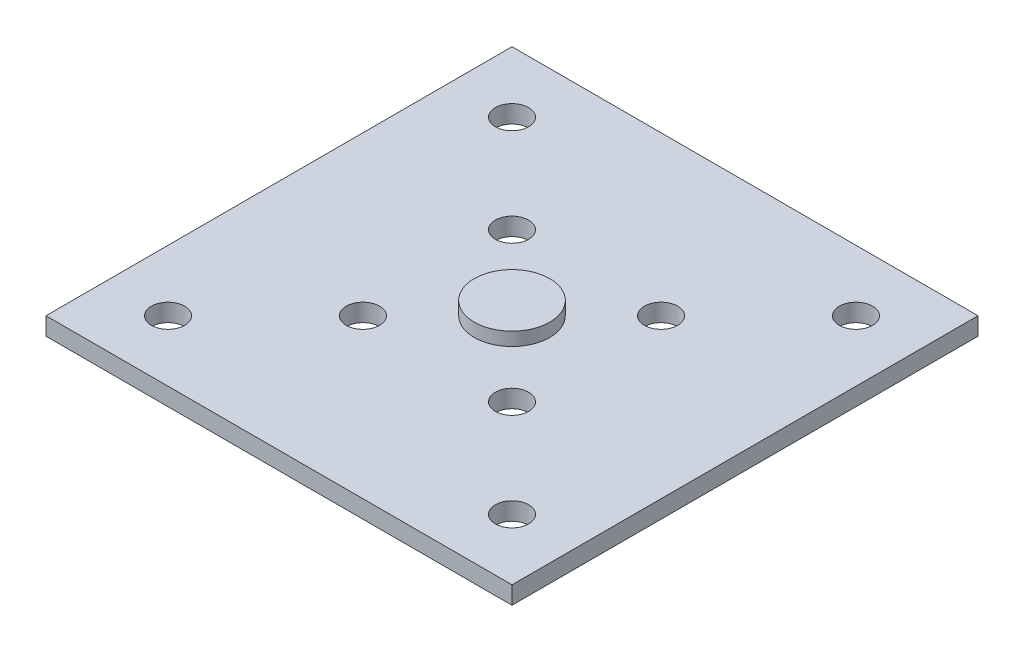
ISO-10303-21;
HEADER;
FILE_DESCRIPTION(('STEP AP214'),'2;1');
FILE_NAME('part.step','',(''),(''),'','','');
FILE_SCHEMA(('AUTOMOTIVE_DESIGN { 1 0 10303 214 1 1 1 1 }'));
ENDSEC;
DATA;
#1=APPLICATION_CONTEXT('core data for automotive mechanical design processes');
#2=APPLICATION_PROTOCOL_DEFINITION('international standard','automotive_design',2000,#1);
#3=PRODUCT_CONTEXT('',#1,'mechanical');
#4=PRODUCT('Part','Part','',(#3));
#5=PRODUCT_RELATED_PRODUCT_CATEGORY('part','',(#4));
#6=PRODUCT_DEFINITION_FORMATION('','',#4);
#7=PRODUCT_DEFINITION_CONTEXT('part definition',#1,'design');
#8=PRODUCT_DEFINITION('design','',#6,#7);
#9=PRODUCT_DEFINITION_SHAPE('','',#8);
#10=(LENGTH_UNIT() NAMED_UNIT(*) SI_UNIT(.MILLI.,.METRE.));
#11=(NAMED_UNIT(*) PLANE_ANGLE_UNIT() SI_UNIT($,.RADIAN.));
#12=(NAMED_UNIT(*) SI_UNIT($,.STERADIAN.) SOLID_ANGLE_UNIT());
#13=UNCERTAINTY_MEASURE_WITH_UNIT(LENGTH_MEASURE(1.E-05),#10,'distance_accuracy_value','');
#14=(GEOMETRIC_REPRESENTATION_CONTEXT(3) GLOBAL_UNCERTAINTY_ASSIGNED_CONTEXT((#13)) GLOBAL_UNIT_ASSIGNED_CONTEXT((#10,
#11,#12)) REPRESENTATION_CONTEXT('',''));
#15=CARTESIAN_POINT('',(0.,0.,0.));
#16=DIRECTION('',(0.,0.,1.));
#17=DIRECTION('',(1.,0.,0.));
#18=AXIS2_PLACEMENT_3D('',#15,#16,#17);
#19=CARTESIAN_POINT('',(0.,1.6,0.));
#20=DIRECTION('',(1.,0.,0.));
#21=DIRECTION('',(0.,0.,-1.));
#22=AXIS2_PLACEMENT_3D('',#19,#20,#21);
#23=PLANE('',#22);
#24=DIRECTION('',(0.,0.,1.));
#25=VECTOR('',#24,1.);
#26=CARTESIAN_POINT('',(0.,0.,0.));
#27=LINE('',#26,#25);
#28=CARTESIAN_POINT('',(0.,0.,-42.));
#29=VERTEX_POINT('',#28);
#30=CARTESIAN_POINT('',(0.,0.,0.));
#31=VERTEX_POINT('',#30);
#32=EDGE_CURVE('E108',#29,#31,#27,.T.);
#33=ORIENTED_EDGE('',*,*,#32,.T.);
#34=DIRECTION('',(0.,-1.,0.));
#35=VECTOR('',#34,1.);
#36=CARTESIAN_POINT('',(0.,1.6,0.));
#37=LINE('',#36,#35);
#38=CARTESIAN_POINT('',(0.,1.6,0.));
#39=VERTEX_POINT('',#38);
#40=EDGE_CURVE('E49',#39,#31,#37,.T.);
#41=ORIENTED_EDGE('',*,*,#40,.F.);
#42=DIRECTION('',(0.,0.,1.));
#43=VECTOR('',#42,1.);
#44=CARTESIAN_POINT('',(0.,1.6,0.));
#45=LINE('',#44,#43);
#46=CARTESIAN_POINT('',(0.,1.6,-42.));
#47=VERTEX_POINT('',#46);
#48=EDGE_CURVE('E94',#47,#39,#45,.T.);
#49=ORIENTED_EDGE('',*,*,#48,.F.);
#50=DIRECTION('',(0.,-1.,0.));
#51=VECTOR('',#50,1.);
#52=CARTESIAN_POINT('',(0.,1.6,-42.));
#53=LINE('',#52,#51);
#54=EDGE_CURVE('E104',#47,#29,#53,.T.);
#55=ORIENTED_EDGE('',*,*,#54,.T.);
#56=EDGE_LOOP('',(#33,#41,#49,#55));
#57=FACE_BOUND('',#56,.T.);
#58=ADVANCED_FACE('F40',(#57),#23,.F.);
#59=CARTESIAN_POINT('',(0.,1.6,0.));
#60=DIRECTION('',(0.,0.,-1.));
#61=DIRECTION('',(-1.,0.,0.));
#62=AXIS2_PLACEMENT_3D('',#59,#60,#61);
#63=PLANE('',#62);
#64=DIRECTION('',(1.,0.,0.));
#65=VECTOR('',#64,1.);
#66=CARTESIAN_POINT('',(0.,0.,0.));
#67=LINE('',#66,#65);
#68=CARTESIAN_POINT('',(42.,0.,0.));
#69=VERTEX_POINT('',#68);
#70=EDGE_CURVE('E99',#31,#69,#67,.T.);
#71=ORIENTED_EDGE('',*,*,#70,.T.);
#72=DIRECTION('',(0.,-1.,0.));
#73=VECTOR('',#72,1.);
#74=CARTESIAN_POINT('',(42.,1.6,0.));
#75=LINE('',#74,#73);
#76=CARTESIAN_POINT('',(42.,1.6,0.));
#77=VERTEX_POINT('',#76);
#78=EDGE_CURVE('E97',#77,#69,#75,.T.);
#79=ORIENTED_EDGE('',*,*,#78,.F.);
#80=DIRECTION('',(1.,0.,0.));
#81=VECTOR('',#80,1.);
#82=CARTESIAN_POINT('',(0.,1.6,0.));
#83=LINE('',#82,#81);
#84=EDGE_CURVE('E89',#39,#77,#83,.T.);
#85=ORIENTED_EDGE('',*,*,#84,.F.);
#86=ORIENTED_EDGE('',*,*,#40,.T.);
#87=EDGE_LOOP('',(#71,#79,#85,#86));
#88=FACE_BOUND('',#87,.T.);
#89=ADVANCED_FACE('F98',(#88),#63,.F.);
#90=CARTESIAN_POINT('',(42.,1.6,0.));
#91=DIRECTION('',(-1.,0.,0.));
#92=DIRECTION('',(0.,0.,1.));
#93=AXIS2_PLACEMENT_3D('',#90,#91,#92);
#94=PLANE('',#93);
#95=DIRECTION('',(0.,0.,-1.));
#96=VECTOR('',#95,1.);
#97=CARTESIAN_POINT('',(42.,0.,0.));
#98=LINE('',#97,#96);
#99=CARTESIAN_POINT('',(42.,0.,-42.));
#100=VERTEX_POINT('',#99);
#101=EDGE_CURVE('E75',#69,#100,#98,.T.);
#102=ORIENTED_EDGE('',*,*,#101,.T.);
#103=DIRECTION('',(0.,-1.,0.));
#104=VECTOR('',#103,1.);
#105=CARTESIAN_POINT('',(42.,1.6,-42.));
#106=LINE('',#105,#104);
#107=CARTESIAN_POINT('',(42.,1.6,-42.));
#108=VERTEX_POINT('',#107);
#109=EDGE_CURVE('E100',#108,#100,#106,.T.);
#110=ORIENTED_EDGE('',*,*,#109,.F.);
#111=DIRECTION('',(0.,0.,-1.));
#112=VECTOR('',#111,1.);
#113=CARTESIAN_POINT('',(42.,1.6,0.));
#114=LINE('',#113,#112);
#115=EDGE_CURVE('E92',#77,#108,#114,.T.);
#116=ORIENTED_EDGE('',*,*,#115,.F.);
#117=ORIENTED_EDGE('',*,*,#78,.T.);
#118=EDGE_LOOP('',(#102,#110,#116,#117));
#119=FACE_BOUND('',#118,.T.);
#120=ADVANCED_FACE('F102',(#119),#94,.F.);
#121=CARTESIAN_POINT('',(0.,1.6,-42.));
#122=DIRECTION('',(0.,0.,1.));
#123=DIRECTION('',(1.,0.,0.));
#124=AXIS2_PLACEMENT_3D('',#121,#122,#123);
#125=PLANE('',#124);
#126=DIRECTION('',(-1.,0.,0.));
#127=VECTOR('',#126,1.);
#128=CARTESIAN_POINT('',(0.,0.,-42.));
#129=LINE('',#128,#127);
#130=EDGE_CURVE('E81',#100,#29,#129,.T.);
#131=ORIENTED_EDGE('',*,*,#130,.T.);
#132=ORIENTED_EDGE('',*,*,#54,.F.);
#133=DIRECTION('',(-1.,0.,0.));
#134=VECTOR('',#133,1.);
#135=CARTESIAN_POINT('',(0.,1.6,-42.));
#136=LINE('',#135,#134);
#137=EDGE_CURVE('E58',#108,#47,#136,.T.);
#138=ORIENTED_EDGE('',*,*,#137,.F.);
#139=ORIENTED_EDGE('',*,*,#109,.T.);
#140=EDGE_LOOP('',(#131,#132,#138,#139));
#141=FACE_BOUND('',#140,.T.);
#142=ADVANCED_FACE('F167',(#141),#125,.F.);
#143=CARTESIAN_POINT('',(0.,1.6,0.));
#144=DIRECTION('',(0.,-1.,0.));
#145=DIRECTION('',(0.,0.,-1.));
#146=AXIS2_PLACEMENT_3D('',#143,#144,#145);
#147=PLANE('',#146);
#148=CARTESIAN_POINT('',(27.7175144212722,1.6,-27.7175144212722));
#149=DIRECTION('',(0.,1.,0.));
#150=DIRECTION('',(0.,0.,1.));
#151=AXIS2_PLACEMENT_3D('',#148,#149,#150);
#152=CIRCLE('',#151,1.5);
#153=CARTESIAN_POINT('',(27.7175144212722,1.6,-26.2175144212722));
#154=VERTEX_POINT('',#153);
#155=EDGE_CURVE('E308',#154,#154,#152,.T.);
#156=ORIENTED_EDGE('',*,*,#155,.F.);
#157=EDGE_LOOP('',(#156));
#158=FACE_BOUND('',#157,.T.);
#159=CARTESIAN_POINT('',(14.2824855787278,1.6,-14.2824855787278));
#160=DIRECTION('',(0.,1.,0.));
#161=DIRECTION('',(0.,0.,1.));
#162=AXIS2_PLACEMENT_3D('',#159,#160,#161);
#163=CIRCLE('',#162,1.5);
#164=CARTESIAN_POINT('',(14.2824855787278,1.6,-12.7824855787278));
#165=VERTEX_POINT('',#164);
#166=EDGE_CURVE('E309',#165,#165,#163,.T.);
#167=ORIENTED_EDGE('',*,*,#166,.F.);
#168=EDGE_LOOP('',(#167));
#169=FACE_BOUND('',#168,.T.);
#170=CARTESIAN_POINT('',(27.7175144212722,1.6,-14.2824855787278));
#171=DIRECTION('',(0.,1.,0.));
#172=DIRECTION('',(0.,0.,1.));
#173=AXIS2_PLACEMENT_3D('',#170,#171,#172);
#174=CIRCLE('',#173,1.5);
#175=CARTESIAN_POINT('',(27.7175144212722,1.6,-12.7824855787278));
#176=VERTEX_POINT('',#175);
#177=EDGE_CURVE('E313',#176,#176,#174,.T.);
#178=ORIENTED_EDGE('',*,*,#177,.F.);
#179=EDGE_LOOP('',(#178));
#180=FACE_BOUND('',#179,.T.);
#181=CARTESIAN_POINT('',(14.2824855787278,1.6,-27.7175144212722));
#182=DIRECTION('',(0.,1.,0.));
#183=DIRECTION('',(0.,0.,1.));
#184=AXIS2_PLACEMENT_3D('',#181,#182,#183);
#185=CIRCLE('',#184,1.5);
#186=CARTESIAN_POINT('',(14.2824855787278,1.6,-26.2175144212722));
#187=VERTEX_POINT('',#186);
#188=EDGE_CURVE('E122',#187,#187,#185,.T.);
#189=ORIENTED_EDGE('',*,*,#188,.F.);
#190=EDGE_LOOP('',(#189));
#191=FACE_BOUND('',#190,.T.);
#192=CARTESIAN_POINT('',(21.,1.6,-21.));
#193=DIRECTION('',(0.,-1.,0.));
#194=DIRECTION('',(0.,0.,-1.));
#195=AXIS2_PLACEMENT_3D('',#192,#193,#194);
#196=CIRCLE('',#195,3.4);
#197=CARTESIAN_POINT('',(21.,1.6,-24.4));
#198=VERTEX_POINT('',#197);
#199=EDGE_CURVE('E11',#198,#198,#196,.F.);
#200=ORIENTED_EDGE('',*,*,#199,.F.);
#201=EDGE_LOOP('',(#200));
#202=FACE_BOUND('',#201,.T.);
#203=CARTESIAN_POINT('',(36.5,1.6,-36.5));
#204=DIRECTION('',(0.,1.,0.));
#205=DIRECTION('',(0.,0.,1.));
#206=AXIS2_PLACEMENT_3D('',#203,#204,#205);
#207=CIRCLE('',#206,1.5);
#208=CARTESIAN_POINT('',(36.5,1.6,-35.));
#209=VERTEX_POINT('',#208);
#210=EDGE_CURVE('E150',#209,#209,#207,.T.);
#211=ORIENTED_EDGE('',*,*,#210,.F.);
#212=EDGE_LOOP('',(#211));
#213=FACE_BOUND('',#212,.T.);
#214=CARTESIAN_POINT('',(5.5,1.6,-5.5));
#215=DIRECTION('',(0.,1.,0.));
#216=DIRECTION('',(0.,0.,1.));
#217=AXIS2_PLACEMENT_3D('',#214,#215,#216);
#218=CIRCLE('',#217,1.5);
#219=CARTESIAN_POINT('',(5.5,1.6,-4.));
#220=VERTEX_POINT('',#219);
#221=EDGE_CURVE('E144',#220,#220,#218,.T.);
#222=ORIENTED_EDGE('',*,*,#221,.F.);
#223=EDGE_LOOP('',(#222));
#224=FACE_BOUND('',#223,.T.);
#225=CARTESIAN_POINT('',(36.5,1.6,-5.5));
#226=DIRECTION('',(0.,1.,0.));
#227=DIRECTION('',(0.,0.,1.));
#228=AXIS2_PLACEMENT_3D('',#225,#226,#227);
#229=CIRCLE('',#228,1.5);
#230=CARTESIAN_POINT('',(36.5,1.6,-4.));
#231=VERTEX_POINT('',#230);
#232=EDGE_CURVE('E133',#231,#231,#229,.T.);
#233=ORIENTED_EDGE('',*,*,#232,.F.);
#234=EDGE_LOOP('',(#233));
#235=FACE_BOUND('',#234,.T.);
#236=CARTESIAN_POINT('',(5.5,1.6,-36.5));
#237=DIRECTION('',(0.,1.,0.));
#238=DIRECTION('',(0.,0.,1.));
#239=AXIS2_PLACEMENT_3D('',#236,#237,#238);
#240=CIRCLE('',#239,1.5);
#241=CARTESIAN_POINT('',(5.5,1.6,-35.));
#242=VERTEX_POINT('',#241);
#243=EDGE_CURVE('E149',#242,#242,#240,.T.);
#244=ORIENTED_EDGE('',*,*,#243,.F.);
#245=EDGE_LOOP('',(#244));
#246=FACE_BOUND('',#245,.T.);
#247=ORIENTED_EDGE('',*,*,#48,.T.);
#248=ORIENTED_EDGE('',*,*,#84,.T.);
#249=ORIENTED_EDGE('',*,*,#115,.T.);
#250=ORIENTED_EDGE('',*,*,#137,.T.);
#251=EDGE_LOOP('',(#247,#248,#249,#250));
#252=FACE_BOUND('',#251,.T.);
#253=ADVANCED_FACE('F90',(#158,#169,#180,#191,#202,#213,#224,#235,#246,#252),#147,.F.);
#254=CARTESIAN_POINT('',(0.,0.,0.));
#255=DIRECTION('',(0.,-1.,0.));
#256=DIRECTION('',(0.,0.,-1.));
#257=AXIS2_PLACEMENT_3D('',#254,#255,#256);
#258=PLANE('',#257);
#259=CARTESIAN_POINT('',(27.7175144212722,0.,-27.7175144212722));
#260=DIRECTION('',(0.,-1.,0.));
#261=DIRECTION('',(0.,0.,-1.));
#262=AXIS2_PLACEMENT_3D('',#259,#260,#261);
#263=CIRCLE('',#262,1.5);
#264=CARTESIAN_POINT('',(27.7175144212722,0.,-29.2175144212722));
#265=VERTEX_POINT('',#264);
#266=EDGE_CURVE('E43',#265,#265,#263,.T.);
#267=ORIENTED_EDGE('',*,*,#266,.F.);
#268=EDGE_LOOP('',(#267));
#269=FACE_BOUND('',#268,.T.);
#270=CARTESIAN_POINT('',(14.2824855787278,0.,-14.2824855787278));
#271=DIRECTION('',(0.,-1.,0.));
#272=DIRECTION('',(0.,0.,-1.));
#273=AXIS2_PLACEMENT_3D('',#270,#271,#272);
#274=CIRCLE('',#273,1.5);
#275=CARTESIAN_POINT('',(14.2824855787278,0.,-15.7824855787278));
#276=VERTEX_POINT('',#275);
#277=EDGE_CURVE('E124',#276,#276,#274,.T.);
#278=ORIENTED_EDGE('',*,*,#277,.F.);
#279=EDGE_LOOP('',(#278));
#280=FACE_BOUND('',#279,.T.);
#281=CARTESIAN_POINT('',(27.7175144212722,0.,-14.2824855787278));
#282=DIRECTION('',(0.,-1.,0.));
#283=DIRECTION('',(0.,0.,-1.));
#284=AXIS2_PLACEMENT_3D('',#281,#282,#283);
#285=CIRCLE('',#284,1.5);
#286=CARTESIAN_POINT('',(27.7175144212722,0.,-15.7824855787278));
#287=VERTEX_POINT('',#286);
#288=EDGE_CURVE('E121',#287,#287,#285,.T.);
#289=ORIENTED_EDGE('',*,*,#288,.F.);
#290=EDGE_LOOP('',(#289));
#291=FACE_BOUND('',#290,.T.);
#292=CARTESIAN_POINT('',(14.2824855787278,0.,-27.7175144212722));
#293=DIRECTION('',(0.,-1.,0.));
#294=DIRECTION('',(0.,0.,-1.));
#295=AXIS2_PLACEMENT_3D('',#292,#293,#294);
#296=CIRCLE('',#295,1.5);
#297=CARTESIAN_POINT('',(14.2824855787278,0.,-29.2175144212722));
#298=VERTEX_POINT('',#297);
#299=EDGE_CURVE('E118',#298,#298,#296,.T.);
#300=ORIENTED_EDGE('',*,*,#299,.F.);
#301=EDGE_LOOP('',(#300));
#302=FACE_BOUND('',#301,.T.);
#303=CARTESIAN_POINT('',(36.5,0.,-36.5));
#304=DIRECTION('',(0.,1.,0.));
#305=DIRECTION('',(0.,0.,1.));
#306=AXIS2_PLACEMENT_3D('',#303,#304,#305);
#307=CIRCLE('',#306,1.5);
#308=CARTESIAN_POINT('',(36.5,0.,-35.));
#309=VERTEX_POINT('',#308);
#310=EDGE_CURVE('E146',#309,#309,#307,.T.);
#311=ORIENTED_EDGE('',*,*,#310,.T.);
#312=EDGE_LOOP('',(#311));
#313=FACE_BOUND('',#312,.T.);
#314=CARTESIAN_POINT('',(5.5,0.,-5.5));
#315=DIRECTION('',(0.,1.,0.));
#316=DIRECTION('',(0.,0.,1.));
#317=AXIS2_PLACEMENT_3D('',#314,#315,#316);
#318=CIRCLE('',#317,1.5);
#319=CARTESIAN_POINT('',(5.5,0.,-4.));
#320=VERTEX_POINT('',#319);
#321=EDGE_CURVE('E153',#320,#320,#318,.T.);
#322=ORIENTED_EDGE('',*,*,#321,.T.);
#323=EDGE_LOOP('',(#322));
#324=FACE_BOUND('',#323,.T.);
#325=CARTESIAN_POINT('',(36.5,0.,-5.5));
#326=DIRECTION('',(0.,1.,0.));
#327=DIRECTION('',(0.,0.,1.));
#328=AXIS2_PLACEMENT_3D('',#325,#326,#327);
#329=CIRCLE('',#328,1.5);
#330=CARTESIAN_POINT('',(36.5,0.,-4.));
#331=VERTEX_POINT('',#330);
#332=EDGE_CURVE('E138',#331,#331,#329,.T.);
#333=ORIENTED_EDGE('',*,*,#332,.T.);
#334=EDGE_LOOP('',(#333));
#335=FACE_BOUND('',#334,.T.);
#336=CARTESIAN_POINT('',(5.5,0.,-36.5));
#337=DIRECTION('',(0.,1.,0.));
#338=DIRECTION('',(0.,0.,1.));
#339=AXIS2_PLACEMENT_3D('',#336,#337,#338);
#340=CIRCLE('',#339,1.5);
#341=CARTESIAN_POINT('',(5.5,0.,-35.));
#342=VERTEX_POINT('',#341);
#343=EDGE_CURVE('E111',#342,#342,#340,.T.);
#344=ORIENTED_EDGE('',*,*,#343,.T.);
#345=EDGE_LOOP('',(#344));
#346=FACE_BOUND('',#345,.T.);
#347=ORIENTED_EDGE('',*,*,#32,.F.);
#348=ORIENTED_EDGE('',*,*,#130,.F.);
#349=ORIENTED_EDGE('',*,*,#101,.F.);
#350=ORIENTED_EDGE('',*,*,#70,.F.);
#351=EDGE_LOOP('',(#347,#348,#349,#350));
#352=FACE_BOUND('',#351,.T.);
#353=ADVANCED_FACE('F166',(#269,#280,#291,#302,#313,#324,#335,#346,#352),#258,.T.);
#354=CARTESIAN_POINT('',(5.5,0.,-36.5));
#355=DIRECTION('',(0.,1.,0.));
#356=DIRECTION('',(0.,0.,1.));
#357=AXIS2_PLACEMENT_3D('',#354,#355,#356);
#358=CYLINDRICAL_SURFACE('',#357,1.5);
#359=ORIENTED_EDGE('',*,*,#343,.F.);
#360=EDGE_LOOP('',(#359));
#361=FACE_BOUND('',#360,.T.);
#362=ORIENTED_EDGE('',*,*,#243,.T.);
#363=EDGE_LOOP('',(#362));
#364=FACE_BOUND('',#363,.T.);
#365=ADVANCED_FACE('F163',(#361,#364),#358,.F.);
#366=CARTESIAN_POINT('',(36.5,0.,-5.5));
#367=DIRECTION('',(0.,1.,0.));
#368=DIRECTION('',(0.,0.,1.));
#369=AXIS2_PLACEMENT_3D('',#366,#367,#368);
#370=CYLINDRICAL_SURFACE('',#369,1.5);
#371=ORIENTED_EDGE('',*,*,#332,.F.);
#372=EDGE_LOOP('',(#371));
#373=FACE_BOUND('',#372,.T.);
#374=ORIENTED_EDGE('',*,*,#232,.T.);
#375=EDGE_LOOP('',(#374));
#376=FACE_BOUND('',#375,.T.);
#377=ADVANCED_FACE('F218',(#373,#376),#370,.F.);
#378=CARTESIAN_POINT('',(5.5,0.,-5.5));
#379=DIRECTION('',(0.,1.,0.));
#380=DIRECTION('',(0.,0.,1.));
#381=AXIS2_PLACEMENT_3D('',#378,#379,#380);
#382=CYLINDRICAL_SURFACE('',#381,1.5);
#383=ORIENTED_EDGE('',*,*,#321,.F.);
#384=EDGE_LOOP('',(#383));
#385=FACE_BOUND('',#384,.T.);
#386=ORIENTED_EDGE('',*,*,#221,.T.);
#387=EDGE_LOOP('',(#386));
#388=FACE_BOUND('',#387,.T.);
#389=ADVANCED_FACE('F224',(#385,#388),#382,.F.);
#390=CARTESIAN_POINT('',(36.5,0.,-36.5));
#391=DIRECTION('',(0.,1.,0.));
#392=DIRECTION('',(0.,0.,1.));
#393=AXIS2_PLACEMENT_3D('',#390,#391,#392);
#394=CYLINDRICAL_SURFACE('',#393,1.5);
#395=ORIENTED_EDGE('',*,*,#310,.F.);
#396=EDGE_LOOP('',(#395));
#397=FACE_BOUND('',#396,.T.);
#398=ORIENTED_EDGE('',*,*,#210,.T.);
#399=EDGE_LOOP('',(#398));
#400=FACE_BOUND('',#399,.T.);
#401=ADVANCED_FACE('F232',(#397,#400),#394,.F.);
#402=CARTESIAN_POINT('',(21.,2.8,-21.));
#403=DIRECTION('',(0.,-1.,0.));
#404=DIRECTION('',(0.,0.,-1.));
#405=AXIS2_PLACEMENT_3D('',#402,#403,#404);
#406=CYLINDRICAL_SURFACE('',#405,3.4);
#407=CARTESIAN_POINT('',(21.,2.8,-21.));
#408=DIRECTION('',(0.,1.,0.));
#409=DIRECTION('',(0.,0.,1.));
#410=AXIS2_PLACEMENT_3D('',#407,#408,#409);
#411=CIRCLE('',#410,3.4);
#412=CARTESIAN_POINT('',(21.,2.8,-17.6));
#413=VERTEX_POINT('',#412);
#414=EDGE_CURVE('E129',#413,#413,#411,.T.);
#415=ORIENTED_EDGE('',*,*,#414,.F.);
#416=EDGE_LOOP('',(#415));
#417=FACE_BOUND('',#416,.T.);
#418=ORIENTED_EDGE('',*,*,#199,.T.);
#419=EDGE_LOOP('',(#418));
#420=FACE_BOUND('',#419,.T.);
#421=ADVANCED_FACE('F240',(#417,#420),#406,.T.);
#422=CARTESIAN_POINT('',(21.,2.8,-21.));
#423=DIRECTION('',(0.,1.,0.));
#424=DIRECTION('',(0.,0.,1.));
#425=AXIS2_PLACEMENT_3D('',#422,#423,#424);
#426=PLANE('',#425);
#427=ORIENTED_EDGE('',*,*,#414,.T.);
#428=EDGE_LOOP('',(#427));
#429=FACE_BOUND('',#428,.T.);
#430=ADVANCED_FACE('F248',(#429),#426,.T.);
#431=CARTESIAN_POINT('',(14.2824855787278,-8.4,-27.7175144212722));
#432=DIRECTION('',(0.,1.,0.));
#433=DIRECTION('',(0.,0.,1.));
#434=AXIS2_PLACEMENT_3D('',#431,#432,#433);
#435=CYLINDRICAL_SURFACE('',#434,1.5);
#436=ORIENTED_EDGE('',*,*,#299,.T.);
#437=EDGE_LOOP('',(#436));
#438=FACE_BOUND('',#437,.T.);
#439=ORIENTED_EDGE('',*,*,#188,.T.);
#440=EDGE_LOOP('',(#439));
#441=FACE_BOUND('',#440,.T.);
#442=ADVANCED_FACE('F255',(#438,#441),#435,.F.);
#443=CARTESIAN_POINT('',(27.7175144212722,-8.4,-14.2824855787278));
#444=DIRECTION('',(0.,1.,0.));
#445=DIRECTION('',(0.,0.,1.));
#446=AXIS2_PLACEMENT_3D('',#443,#444,#445);
#447=CYLINDRICAL_SURFACE('',#446,1.5);
#448=ORIENTED_EDGE('',*,*,#288,.T.);
#449=EDGE_LOOP('',(#448));
#450=FACE_BOUND('',#449,.T.);
#451=ORIENTED_EDGE('',*,*,#177,.T.);
#452=EDGE_LOOP('',(#451));
#453=FACE_BOUND('',#452,.T.);
#454=ADVANCED_FACE('F261',(#450,#453),#447,.F.);
#455=CARTESIAN_POINT('',(14.2824855787278,-8.4,-14.2824855787278));
#456=DIRECTION('',(0.,1.,0.));
#457=DIRECTION('',(0.,0.,1.));
#458=AXIS2_PLACEMENT_3D('',#455,#456,#457);
#459=CYLINDRICAL_SURFACE('',#458,1.5);
#460=ORIENTED_EDGE('',*,*,#277,.T.);
#461=EDGE_LOOP('',(#460));
#462=FACE_BOUND('',#461,.T.);
#463=ORIENTED_EDGE('',*,*,#166,.T.);
#464=EDGE_LOOP('',(#463));
#465=FACE_BOUND('',#464,.T.);
#466=ADVANCED_FACE('F269',(#462,#465),#459,.F.);
#467=CARTESIAN_POINT('',(27.7175144212722,-8.4,-27.7175144212722));
#468=DIRECTION('',(0.,1.,0.));
#469=DIRECTION('',(0.,0.,1.));
#470=AXIS2_PLACEMENT_3D('',#467,#468,#469);
#471=CYLINDRICAL_SURFACE('',#470,1.5);
#472=ORIENTED_EDGE('',*,*,#266,.T.);
#473=EDGE_LOOP('',(#472));
#474=FACE_BOUND('',#473,.T.);
#475=ORIENTED_EDGE('',*,*,#155,.T.);
#476=EDGE_LOOP('',(#475));
#477=FACE_BOUND('',#476,.T.);
#478=ADVANCED_FACE('F277',(#474,#477),#471,.F.);
#479=CLOSED_SHELL('',(#58,#89,#120,#142,#253,#353,#365,#377,#389,#401,#421,#430,#442,#454,#466,#478));
#480=MANIFOLD_SOLID_BREP('B2',#479);
#481=ADVANCED_BREP_SHAPE_REPRESENTATION('',(#18,#480),#14);
#482=SHAPE_DEFINITION_REPRESENTATION(#9,#481);
ENDSEC;
END-ISO-10303-21;
